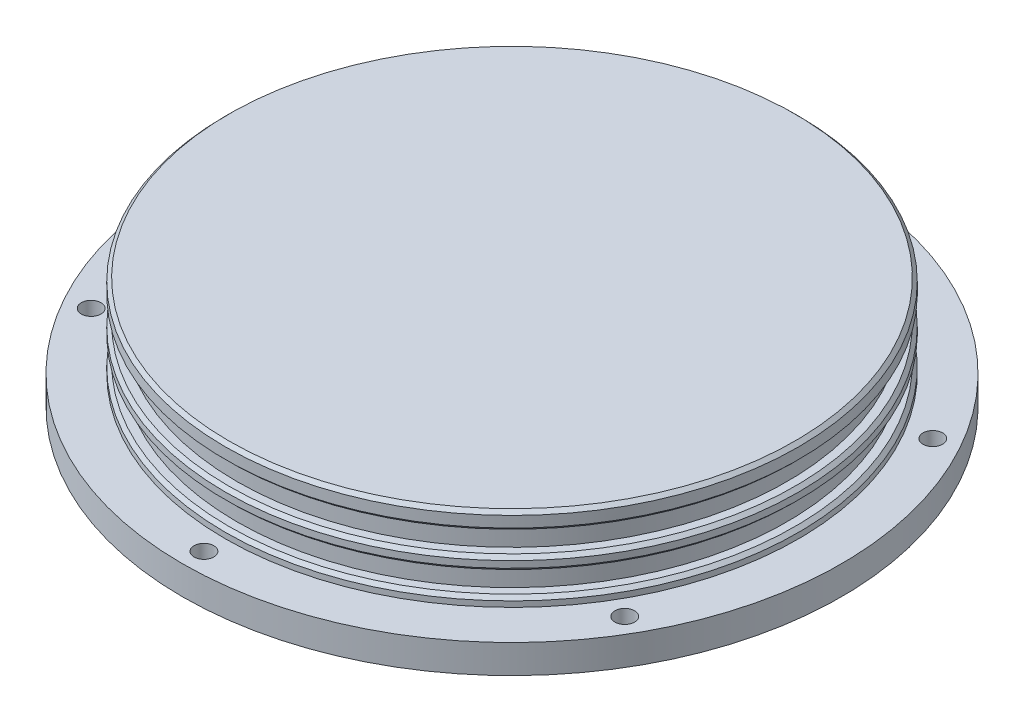
ISO-10303-21;
HEADER;
FILE_DESCRIPTION(('STEP AP214'),'2;1');
FILE_NAME('part.step','',(''),(''),'','','');
FILE_SCHEMA(('AUTOMOTIVE_DESIGN { 1 0 10303 214 1 1 1 1 }'));
ENDSEC;
DATA;
#1=APPLICATION_CONTEXT('core data for automotive mechanical design processes');
#2=APPLICATION_PROTOCOL_DEFINITION('international standard','automotive_design',2000,#1);
#3=PRODUCT_CONTEXT('',#1,'mechanical');
#4=PRODUCT('Part','Part','',(#3));
#5=PRODUCT_RELATED_PRODUCT_CATEGORY('part','',(#4));
#6=PRODUCT_DEFINITION_FORMATION('','',#4);
#7=PRODUCT_DEFINITION_CONTEXT('part definition',#1,'design');
#8=PRODUCT_DEFINITION('design','',#6,#7);
#9=PRODUCT_DEFINITION_SHAPE('','',#8);
#10=(LENGTH_UNIT() NAMED_UNIT(*) SI_UNIT(.MILLI.,.METRE.));
#11=(NAMED_UNIT(*) PLANE_ANGLE_UNIT() SI_UNIT($,.RADIAN.));
#12=(NAMED_UNIT(*) SI_UNIT($,.STERADIAN.) SOLID_ANGLE_UNIT());
#13=UNCERTAINTY_MEASURE_WITH_UNIT(LENGTH_MEASURE(1.E-05),#10,'distance_accuracy_value','');
#14=(GEOMETRIC_REPRESENTATION_CONTEXT(3) GLOBAL_UNCERTAINTY_ASSIGNED_CONTEXT((#13)) GLOBAL_UNIT_ASSIGNED_CONTEXT((#10,
#11,#12)) REPRESENTATION_CONTEXT('',''));
#15=CARTESIAN_POINT('',(0.,0.,0.));
#16=DIRECTION('',(0.,0.,1.));
#17=DIRECTION('',(1.,0.,0.));
#18=AXIS2_PLACEMENT_3D('',#15,#16,#17);
#19=CARTESIAN_POINT('',(0.,12.3825,0.));
#20=DIRECTION('',(0.,-1.,0.));
#21=DIRECTION('',(0.,0.,-1.));
#22=AXIS2_PLACEMENT_3D('',#19,#20,#21);
#23=CYLINDRICAL_SURFACE('',#22,31.75);
#24=CARTESIAN_POINT('',(0.,6.9226397264745,0.));
#25=DIRECTION('',(0.,-1.,0.));
#26=DIRECTION('',(0.,0.,-1.));
#27=AXIS2_PLACEMENT_3D('',#24,#25,#26);
#28=CIRCLE('',#27,31.75);
#29=CARTESIAN_POINT('',(0.,6.9226397264745,-31.75));
#30=VERTEX_POINT('',#29);
#31=EDGE_CURVE('E43',#30,#30,#28,.F.);
#32=ORIENTED_EDGE('',*,*,#31,.T.);
#33=EDGE_LOOP('',(#32));
#34=FACE_BOUND('',#33,.T.);
#35=CARTESIAN_POINT('',(0.,7.66193475746577,0.));
#36=DIRECTION('',(0.,1.,0.));
#37=DIRECTION('',(0.,0.,1.));
#38=AXIS2_PLACEMENT_3D('',#35,#36,#37);
#39=CIRCLE('',#38,31.75);
#40=CARTESIAN_POINT('',(0.,7.66193475746577,31.75));
#41=VERTEX_POINT('',#40);
#42=EDGE_CURVE('E122',#41,#41,#39,.F.);
#43=ORIENTED_EDGE('',*,*,#42,.T.);
#44=EDGE_LOOP('',(#43));
#45=FACE_BOUND('',#44,.T.);
#46=ADVANCED_FACE('F30',(#34,#45),#23,.T.);
#47=CARTESIAN_POINT('',(0.,8.04293475746576,31.75));
#48=DIRECTION('',(0.,1.,0.));
#49=DIRECTION('',(0.,0.,1.));
#50=AXIS2_PLACEMENT_3D('',#47,#48,#49);
#51=PLANE('',#50);
#52=CARTESIAN_POINT('',(0.,8.04293475746576,0.));
#53=DIRECTION('',(0.,1.,0.));
#54=DIRECTION('',(0.,0.,1.));
#55=AXIS2_PLACEMENT_3D('',#52,#53,#54);
#56=CIRCLE('',#55,31.369);
#57=CARTESIAN_POINT('',(0.,8.04293475746576,31.369));
#58=VERTEX_POINT('',#57);
#59=EDGE_CURVE('E38',#58,#58,#56,.T.);
#60=ORIENTED_EDGE('',*,*,#59,.T.);
#61=EDGE_LOOP('',(#60));
#62=FACE_BOUND('',#61,.T.);
#63=CARTESIAN_POINT('',(0.,8.04293475746576,0.));
#64=DIRECTION('',(0.,-1.,0.));
#65=DIRECTION('',(0.,0.,-1.));
#66=AXIS2_PLACEMENT_3D('',#63,#64,#65);
#67=CIRCLE('',#66,30.48);
#68=CARTESIAN_POINT('',(0.,8.04293475746576,-30.48));
#69=VERTEX_POINT('',#68);
#70=EDGE_CURVE('E92',#69,#69,#67,.T.);
#71=ORIENTED_EDGE('',*,*,#70,.T.);
#72=EDGE_LOOP('',(#71));
#73=FACE_BOUND('',#72,.T.);
#74=ADVANCED_FACE('F164',(#62,#73),#51,.T.);
#75=CARTESIAN_POINT('',(0.,0.,0.));
#76=DIRECTION('',(0.,-1.,0.));
#77=DIRECTION('',(0.,0.,-1.));
#78=AXIS2_PLACEMENT_3D('',#75,#76,#77);
#79=CYLINDRICAL_SURFACE('',#78,30.48);
#80=CARTESIAN_POINT('',(0.,10.4051347574658,0.));
#81=DIRECTION('',(0.,-1.,0.));
#82=DIRECTION('',(0.,0.,-1.));
#83=AXIS2_PLACEMENT_3D('',#80,#81,#82);
#84=CIRCLE('',#83,30.48);
#85=CARTESIAN_POINT('',(0.,10.4051347574658,-30.48));
#86=VERTEX_POINT('',#85);
#87=EDGE_CURVE('E89',#86,#86,#84,.T.);
#88=ORIENTED_EDGE('',*,*,#87,.T.);
#89=EDGE_LOOP('',(#88));
#90=FACE_BOUND('',#89,.T.);
#91=ORIENTED_EDGE('',*,*,#70,.F.);
#92=EDGE_LOOP('',(#91));
#93=FACE_BOUND('',#92,.T.);
#94=ADVANCED_FACE('F168',(#90,#93),#79,.T.);
#95=CARTESIAN_POINT('',(0.,10.4051347574658,31.75));
#96=DIRECTION('',(0.,-1.,0.));
#97=DIRECTION('',(0.,0.,-1.));
#98=AXIS2_PLACEMENT_3D('',#95,#96,#97);
#99=PLANE('',#98);
#100=CARTESIAN_POINT('',(0.,10.4051347574658,0.));
#101=DIRECTION('',(0.,-1.,0.));
#102=DIRECTION('',(0.,0.,-1.));
#103=AXIS2_PLACEMENT_3D('',#100,#101,#102);
#104=CIRCLE('',#103,31.369);
#105=CARTESIAN_POINT('',(0.,10.4051347574658,-31.369));
#106=VERTEX_POINT('',#105);
#107=EDGE_CURVE('E10',#106,#106,#104,.T.);
#108=ORIENTED_EDGE('',*,*,#107,.T.);
#109=EDGE_LOOP('',(#108));
#110=FACE_BOUND('',#109,.T.);
#111=ORIENTED_EDGE('',*,*,#87,.F.);
#112=EDGE_LOOP('',(#111));
#113=FACE_BOUND('',#112,.T.);
#114=ADVANCED_FACE('F351',(#110,#113),#99,.T.);
#115=CARTESIAN_POINT('',(0.,12.3825,0.));
#116=DIRECTION('',(0.,1.,0.));
#117=DIRECTION('',(0.,0.,1.));
#118=AXIS2_PLACEMENT_3D('',#115,#116,#117);
#119=PLANE('',#118);
#120=CARTESIAN_POINT('',(0.,12.3825,0.));
#121=DIRECTION('',(0.,1.,0.));
#122=DIRECTION('',(0.,0.,1.));
#123=AXIS2_PLACEMENT_3D('',#120,#121,#122);
#124=CIRCLE('',#123,31.369);
#125=CARTESIAN_POINT('',(0.,12.3825,31.369));
#126=VERTEX_POINT('',#125);
#127=EDGE_CURVE('E104',#126,#126,#124,.T.);
#128=ORIENTED_EDGE('',*,*,#127,.T.);
#129=EDGE_LOOP('',(#128));
#130=FACE_BOUND('',#129,.T.);
#131=ADVANCED_FACE('F158',(#130),#119,.T.);
#132=CARTESIAN_POINT('',(0.,12.0015,0.));
#133=DIRECTION('',(0.,1.,0.));
#134=DIRECTION('',(0.,0.,1.));
#135=AXIS2_PLACEMENT_3D('',#132,#133,#134);
#136=CIRCLE('',#135,31.75);
#137=CARTESIAN_POINT('',(0.,12.0015,31.75));
#138=VERTEX_POINT('',#137);
#139=EDGE_CURVE('E110',#138,#138,#136,.F.);
#140=ORIENTED_EDGE('',*,*,#139,.T.);
#141=EDGE_LOOP('',(#140));
#142=FACE_BOUND('',#141,.T.);
#143=CARTESIAN_POINT('',(0.,10.7861347574658,0.));
#144=DIRECTION('',(0.,-1.,0.));
#145=DIRECTION('',(0.,0.,-1.));
#146=AXIS2_PLACEMENT_3D('',#143,#144,#145);
#147=CIRCLE('',#146,31.75);
#148=CARTESIAN_POINT('',(0.,10.7861347574658,-31.75));
#149=VERTEX_POINT('',#148);
#150=EDGE_CURVE('E107',#149,#149,#147,.F.);
#151=ORIENTED_EDGE('',*,*,#150,.T.);
#152=EDGE_LOOP('',(#151));
#153=FACE_BOUND('',#152,.T.);
#154=ADVANCED_FACE('F152',(#142,#153),#23,.T.);
#155=CARTESIAN_POINT('',(0.,4.1794397264745,31.75));
#156=DIRECTION('',(0.,1.,0.));
#157=DIRECTION('',(0.,0.,1.));
#158=AXIS2_PLACEMENT_3D('',#155,#156,#157);
#159=PLANE('',#158);
#160=CARTESIAN_POINT('',(0.,4.1794397264745,0.));
#161=DIRECTION('',(0.,1.,0.));
#162=DIRECTION('',(0.,0.,1.));
#163=AXIS2_PLACEMENT_3D('',#160,#161,#162);
#164=CIRCLE('',#163,31.369);
#165=CARTESIAN_POINT('',(0.,4.1794397264745,31.369));
#166=VERTEX_POINT('',#165);
#167=EDGE_CURVE('E116',#166,#166,#164,.T.);
#168=ORIENTED_EDGE('',*,*,#167,.T.);
#169=EDGE_LOOP('',(#168));
#170=FACE_BOUND('',#169,.T.);
#171=CARTESIAN_POINT('',(0.,4.1794397264745,0.));
#172=DIRECTION('',(0.,-1.,0.));
#173=DIRECTION('',(0.,0.,-1.));
#174=AXIS2_PLACEMENT_3D('',#171,#172,#173);
#175=CIRCLE('',#174,30.48);
#176=CARTESIAN_POINT('',(0.,4.1794397264745,-30.48));
#177=VERTEX_POINT('',#176);
#178=EDGE_CURVE('E86',#177,#177,#175,.T.);
#179=ORIENTED_EDGE('',*,*,#178,.T.);
#180=EDGE_LOOP('',(#179));
#181=FACE_BOUND('',#180,.T.);
#182=ADVANCED_FACE('F147',(#170,#181),#159,.T.);
#183=CARTESIAN_POINT('',(0.,0.,0.));
#184=DIRECTION('',(0.,-1.,0.));
#185=DIRECTION('',(0.,0.,-1.));
#186=AXIS2_PLACEMENT_3D('',#183,#184,#185);
#187=CYLINDRICAL_SURFACE('',#186,30.48);
#188=CARTESIAN_POINT('',(0.,6.5416397264745,0.));
#189=DIRECTION('',(0.,-1.,0.));
#190=DIRECTION('',(0.,0.,-1.));
#191=AXIS2_PLACEMENT_3D('',#188,#189,#190);
#192=CIRCLE('',#191,30.48);
#193=CARTESIAN_POINT('',(0.,6.5416397264745,-30.48));
#194=VERTEX_POINT('',#193);
#195=EDGE_CURVE('E50',#194,#194,#192,.T.);
#196=ORIENTED_EDGE('',*,*,#195,.T.);
#197=EDGE_LOOP('',(#196));
#198=FACE_BOUND('',#197,.T.);
#199=ORIENTED_EDGE('',*,*,#178,.F.);
#200=EDGE_LOOP('',(#199));
#201=FACE_BOUND('',#200,.T.);
#202=ADVANCED_FACE('F141',(#198,#201),#187,.T.);
#203=CARTESIAN_POINT('',(0.,6.5416397264745,31.75));
#204=DIRECTION('',(0.,-1.,0.));
#205=DIRECTION('',(0.,0.,-1.));
#206=AXIS2_PLACEMENT_3D('',#203,#204,#205);
#207=PLANE('',#206);
#208=CARTESIAN_POINT('',(0.,6.5416397264745,0.));
#209=DIRECTION('',(0.,-1.,0.));
#210=DIRECTION('',(0.,0.,-1.));
#211=AXIS2_PLACEMENT_3D('',#208,#209,#210);
#212=CIRCLE('',#211,31.369);
#213=CARTESIAN_POINT('',(0.,6.5416397264745,-31.369));
#214=VERTEX_POINT('',#213);
#215=EDGE_CURVE('E119',#214,#214,#212,.T.);
#216=ORIENTED_EDGE('',*,*,#215,.T.);
#217=EDGE_LOOP('',(#216));
#218=FACE_BOUND('',#217,.T.);
#219=ORIENTED_EDGE('',*,*,#195,.F.);
#220=EDGE_LOOP('',(#219));
#221=FACE_BOUND('',#220,.T.);
#222=ADVANCED_FACE('F137',(#218,#221),#207,.T.);
#223=CARTESIAN_POINT('',(0.,0.,0.));
#224=DIRECTION('',(0.,1.,0.));
#225=DIRECTION('',(0.,0.,1.));
#226=AXIS2_PLACEMENT_3D('',#223,#224,#225);
#227=PLANE('',#226);
#228=CARTESIAN_POINT('',(-29.5585295629176,0.,17.065625));
#229=DIRECTION('',(0.,-1.,0.));
#230=DIRECTION('',(0.,0.,-1.));
#231=AXIS2_PLACEMENT_3D('',#228,#229,#230);
#232=CIRCLE('',#231,1.0922);
#233=CARTESIAN_POINT('',(-29.5585295629176,0.,15.973425));
#234=VERTEX_POINT('',#233);
#235=EDGE_CURVE('E75',#234,#234,#232,.T.);
#236=ORIENTED_EDGE('',*,*,#235,.F.);
#237=EDGE_LOOP('',(#236));
#238=FACE_BOUND('',#237,.T.);
#239=CARTESIAN_POINT('',(0.,0.,34.13125));
#240=DIRECTION('',(0.,-1.,0.));
#241=DIRECTION('',(0.,0.,-1.));
#242=AXIS2_PLACEMENT_3D('',#239,#240,#241);
#243=CIRCLE('',#242,1.0922);
#244=CARTESIAN_POINT('',(0.,0.,33.03905));
#245=VERTEX_POINT('',#244);
#246=EDGE_CURVE('E65',#245,#245,#243,.T.);
#247=ORIENTED_EDGE('',*,*,#246,.F.);
#248=EDGE_LOOP('',(#247));
#249=FACE_BOUND('',#248,.T.);
#250=CARTESIAN_POINT('',(29.5585295629176,0.,17.065625));
#251=DIRECTION('',(0.,-1.,0.));
#252=DIRECTION('',(0.,0.,-1.));
#253=AXIS2_PLACEMENT_3D('',#250,#251,#252);
#254=CIRCLE('',#253,1.0922);
#255=CARTESIAN_POINT('',(29.5585295629176,0.,15.973425));
#256=VERTEX_POINT('',#255);
#257=EDGE_CURVE('E62',#256,#256,#254,.T.);
#258=ORIENTED_EDGE('',*,*,#257,.F.);
#259=EDGE_LOOP('',(#258));
#260=FACE_BOUND('',#259,.T.);
#261=CARTESIAN_POINT('',(29.5585295629176,0.,-17.065625));
#262=DIRECTION('',(0.,-1.,0.));
#263=DIRECTION('',(0.,0.,-1.));
#264=AXIS2_PLACEMENT_3D('',#261,#262,#263);
#265=CIRCLE('',#264,1.0922);
#266=CARTESIAN_POINT('',(29.5585295629176,0.,-18.157825));
#267=VERTEX_POINT('',#266);
#268=EDGE_CURVE('E59',#267,#267,#265,.T.);
#269=ORIENTED_EDGE('',*,*,#268,.F.);
#270=EDGE_LOOP('',(#269));
#271=FACE_BOUND('',#270,.T.);
#272=CARTESIAN_POINT('',(0.,0.,-34.13125));
#273=DIRECTION('',(0.,-1.,0.));
#274=DIRECTION('',(0.,0.,-1.));
#275=AXIS2_PLACEMENT_3D('',#272,#273,#274);
#276=CIRCLE('',#275,1.0922);
#277=CARTESIAN_POINT('',(0.,0.,-35.22345));
#278=VERTEX_POINT('',#277);
#279=EDGE_CURVE('E55',#278,#278,#276,.T.);
#280=ORIENTED_EDGE('',*,*,#279,.F.);
#281=EDGE_LOOP('',(#280));
#282=FACE_BOUND('',#281,.T.);
#283=CARTESIAN_POINT('',(-29.5585295629176,0.,-17.065625));
#284=DIRECTION('',(0.,-1.,0.));
#285=DIRECTION('',(0.,0.,-1.));
#286=AXIS2_PLACEMENT_3D('',#283,#284,#285);
#287=CIRCLE('',#286,1.0922);
#288=CARTESIAN_POINT('',(-29.5585295629176,0.,-18.157825));
#289=VERTEX_POINT('',#288);
#290=EDGE_CURVE('E51',#289,#289,#287,.T.);
#291=ORIENTED_EDGE('',*,*,#290,.F.);
#292=EDGE_LOOP('',(#291));
#293=FACE_BOUND('',#292,.T.);
#294=CARTESIAN_POINT('',(0.,0.,0.));
#295=DIRECTION('',(0.,1.,0.));
#296=DIRECTION('',(0.,0.,1.));
#297=AXIS2_PLACEMENT_3D('',#294,#295,#296);
#298=CIRCLE('',#297,36.5125);
#299=CARTESIAN_POINT('',(0.,0.,36.5125));
#300=VERTEX_POINT('',#299);
#301=EDGE_CURVE('E98',#300,#300,#298,.T.);
#302=ORIENTED_EDGE('',*,*,#301,.F.);
#303=EDGE_LOOP('',(#302));
#304=FACE_BOUND('',#303,.T.);
#305=ADVANCED_FACE('F140',(#238,#249,#260,#271,#282,#293,#304),#227,.F.);
#306=CARTESIAN_POINT('',(0.,3.175,0.));
#307=DIRECTION('',(0.,-1.,0.));
#308=DIRECTION('',(0.,0.,-1.));
#309=AXIS2_PLACEMENT_3D('',#306,#307,#308);
#310=CYLINDRICAL_SURFACE('',#309,36.5125);
#311=CARTESIAN_POINT('',(0.,3.175,0.));
#312=DIRECTION('',(0.,1.,0.));
#313=DIRECTION('',(0.,0.,1.));
#314=AXIS2_PLACEMENT_3D('',#311,#312,#313);
#315=CIRCLE('',#314,36.5125);
#316=CARTESIAN_POINT('',(0.,3.175,36.5125));
#317=VERTEX_POINT('',#316);
#318=EDGE_CURVE('E101',#317,#317,#315,.T.);
#319=ORIENTED_EDGE('',*,*,#318,.F.);
#320=EDGE_LOOP('',(#319));
#321=FACE_BOUND('',#320,.T.);
#322=ORIENTED_EDGE('',*,*,#301,.T.);
#323=EDGE_LOOP('',(#322));
#324=FACE_BOUND('',#323,.T.);
#325=ADVANCED_FACE('F32',(#321,#324),#310,.T.);
#326=CARTESIAN_POINT('',(0.,3.175,0.));
#327=DIRECTION('',(0.,1.,0.));
#328=DIRECTION('',(0.,0.,1.));
#329=AXIS2_PLACEMENT_3D('',#326,#327,#328);
#330=PLANE('',#329);
#331=CARTESIAN_POINT('',(-29.5585295629176,3.175,17.065625));
#332=DIRECTION('',(0.,1.,0.));
#333=DIRECTION('',(0.,0.,1.));
#334=AXIS2_PLACEMENT_3D('',#331,#332,#333);
#335=CIRCLE('',#334,1.0922);
#336=CARTESIAN_POINT('',(-29.5585295629176,3.175,18.157825));
#337=VERTEX_POINT('',#336);
#338=EDGE_CURVE('E34',#337,#337,#335,.T.);
#339=ORIENTED_EDGE('',*,*,#338,.F.);
#340=EDGE_LOOP('',(#339));
#341=FACE_BOUND('',#340,.T.);
#342=CARTESIAN_POINT('',(0.,3.175,34.13125));
#343=DIRECTION('',(0.,1.,0.));
#344=DIRECTION('',(0.,0.,1.));
#345=AXIS2_PLACEMENT_3D('',#342,#343,#344);
#346=CIRCLE('',#345,1.0922);
#347=CARTESIAN_POINT('',(0.,3.175,35.22345));
#348=VERTEX_POINT('',#347);
#349=EDGE_CURVE('E63',#348,#348,#346,.T.);
#350=ORIENTED_EDGE('',*,*,#349,.F.);
#351=EDGE_LOOP('',(#350));
#352=FACE_BOUND('',#351,.T.);
#353=CARTESIAN_POINT('',(29.5585295629176,3.175,17.065625));
#354=DIRECTION('',(0.,1.,0.));
#355=DIRECTION('',(0.,0.,1.));
#356=AXIS2_PLACEMENT_3D('',#353,#354,#355);
#357=CIRCLE('',#356,1.0922);
#358=CARTESIAN_POINT('',(29.5585295629176,3.175,18.157825));
#359=VERTEX_POINT('',#358);
#360=EDGE_CURVE('E60',#359,#359,#357,.T.);
#361=ORIENTED_EDGE('',*,*,#360,.F.);
#362=EDGE_LOOP('',(#361));
#363=FACE_BOUND('',#362,.T.);
#364=CARTESIAN_POINT('',(29.5585295629176,3.175,-17.065625));
#365=DIRECTION('',(0.,1.,0.));
#366=DIRECTION('',(0.,0.,1.));
#367=AXIS2_PLACEMENT_3D('',#364,#365,#366);
#368=CIRCLE('',#367,1.0922);
#369=CARTESIAN_POINT('',(29.5585295629176,3.175,-15.973425));
#370=VERTEX_POINT('',#369);
#371=EDGE_CURVE('E56',#370,#370,#368,.T.);
#372=ORIENTED_EDGE('',*,*,#371,.F.);
#373=EDGE_LOOP('',(#372));
#374=FACE_BOUND('',#373,.T.);
#375=CARTESIAN_POINT('',(0.,3.175,-34.13125));
#376=DIRECTION('',(0.,1.,0.));
#377=DIRECTION('',(0.,0.,1.));
#378=AXIS2_PLACEMENT_3D('',#375,#376,#377);
#379=CIRCLE('',#378,1.0922);
#380=CARTESIAN_POINT('',(0.,3.175,-33.03905));
#381=VERTEX_POINT('',#380);
#382=EDGE_CURVE('E52',#381,#381,#379,.T.);
#383=ORIENTED_EDGE('',*,*,#382,.F.);
#384=EDGE_LOOP('',(#383));
#385=FACE_BOUND('',#384,.T.);
#386=CARTESIAN_POINT('',(-29.5585295629176,3.175,-17.065625));
#387=DIRECTION('',(0.,1.,0.));
#388=DIRECTION('',(0.,0.,1.));
#389=AXIS2_PLACEMENT_3D('',#386,#387,#388);
#390=CIRCLE('',#389,1.0922);
#391=CARTESIAN_POINT('',(-29.5585295629176,3.175,-15.973425));
#392=VERTEX_POINT('',#391);
#393=EDGE_CURVE('E47',#392,#392,#390,.T.);
#394=ORIENTED_EDGE('',*,*,#393,.F.);
#395=EDGE_LOOP('',(#394));
#396=FACE_BOUND('',#395,.T.);
#397=ORIENTED_EDGE('',*,*,#318,.T.);
#398=EDGE_LOOP('',(#397));
#399=FACE_BOUND('',#398,.T.);
#400=CARTESIAN_POINT('',(0.,3.175,0.));
#401=DIRECTION('',(0.,1.,0.));
#402=DIRECTION('',(0.,0.,1.));
#403=AXIS2_PLACEMENT_3D('',#400,#401,#402);
#404=CIRCLE('',#403,31.75);
#405=CARTESIAN_POINT('',(0.,3.175,31.75));
#406=VERTEX_POINT('',#405);
#407=EDGE_CURVE('E95',#406,#406,#404,.T.);
#408=ORIENTED_EDGE('',*,*,#407,.F.);
#409=EDGE_LOOP('',(#408));
#410=FACE_BOUND('',#409,.T.);
#411=ADVANCED_FACE('F175',(#341,#352,#363,#374,#385,#396,#399,#410),#330,.T.);
#412=CARTESIAN_POINT('',(0.,3.79843972647449,0.));
#413=DIRECTION('',(0.,1.,0.));
#414=DIRECTION('',(0.,0.,1.));
#415=AXIS2_PLACEMENT_3D('',#412,#413,#414);
#416=CIRCLE('',#415,31.75);
#417=CARTESIAN_POINT('',(0.,3.79843972647449,31.75));
#418=VERTEX_POINT('',#417);
#419=EDGE_CURVE('E113',#418,#418,#416,.F.);
#420=ORIENTED_EDGE('',*,*,#419,.T.);
#421=EDGE_LOOP('',(#420));
#422=FACE_BOUND('',#421,.T.);
#423=ORIENTED_EDGE('',*,*,#407,.T.);
#424=EDGE_LOOP('',(#423));
#425=FACE_BOUND('',#424,.T.);
#426=ADVANCED_FACE('F161',(#422,#425),#23,.T.);
#427=CARTESIAN_POINT('',(0.,12.3825,0.));
#428=DIRECTION('',(0.,-1.,0.));
#429=DIRECTION('',(0.,0.,-1.));
#430=AXIS2_PLACEMENT_3D('',#427,#428,#429);
#431=CONICAL_SURFACE('',#430,31.369,0.785398163397457);
#432=ORIENTED_EDGE('',*,*,#139,.F.);
#433=EDGE_LOOP('',(#432));
#434=FACE_BOUND('',#433,.T.);
#435=ORIENTED_EDGE('',*,*,#127,.F.);
#436=EDGE_LOOP('',(#435));
#437=FACE_BOUND('',#436,.T.);
#438=ADVANCED_FACE('F174',(#434,#437),#431,.T.);
#439=CARTESIAN_POINT('',(0.,3.79843972647449,0.));
#440=DIRECTION('',(0.,-1.,0.));
#441=DIRECTION('',(0.,0.,-1.));
#442=AXIS2_PLACEMENT_3D('',#439,#440,#441);
#443=CONICAL_SURFACE('',#442,31.75,0.785398163397457);
#444=ORIENTED_EDGE('',*,*,#167,.F.);
#445=EDGE_LOOP('',(#444));
#446=FACE_BOUND('',#445,.T.);
#447=ORIENTED_EDGE('',*,*,#419,.F.);
#448=EDGE_LOOP('',(#447));
#449=FACE_BOUND('',#448,.T.);
#450=ADVANCED_FACE('F133',(#446,#449),#443,.T.);
#451=CARTESIAN_POINT('',(0.,6.5416397264745,0.));
#452=DIRECTION('',(0.,1.,0.));
#453=DIRECTION('',(0.,0.,1.));
#454=AXIS2_PLACEMENT_3D('',#451,#452,#453);
#455=CONICAL_SURFACE('',#454,31.369,0.785398163397439);
#456=ORIENTED_EDGE('',*,*,#31,.F.);
#457=EDGE_LOOP('',(#456));
#458=FACE_BOUND('',#457,.T.);
#459=ORIENTED_EDGE('',*,*,#215,.F.);
#460=EDGE_LOOP('',(#459));
#461=FACE_BOUND('',#460,.T.);
#462=ADVANCED_FACE('F129',(#458,#461),#455,.T.);
#463=CARTESIAN_POINT('',(0.,7.66193475746577,0.));
#464=DIRECTION('',(0.,-1.,0.));
#465=DIRECTION('',(0.,0.,-1.));
#466=AXIS2_PLACEMENT_3D('',#463,#464,#465);
#467=CONICAL_SURFACE('',#466,31.75,0.785398163397448);
#468=ORIENTED_EDGE('',*,*,#59,.F.);
#469=EDGE_LOOP('',(#468));
#470=FACE_BOUND('',#469,.T.);
#471=ORIENTED_EDGE('',*,*,#42,.F.);
#472=EDGE_LOOP('',(#471));
#473=FACE_BOUND('',#472,.T.);
#474=ADVANCED_FACE('F132',(#470,#473),#467,.T.);
#475=CARTESIAN_POINT('',(0.,10.4051347574658,0.));
#476=DIRECTION('',(0.,1.,0.));
#477=DIRECTION('',(0.,0.,1.));
#478=AXIS2_PLACEMENT_3D('',#475,#476,#477);
#479=CONICAL_SURFACE('',#478,31.369,0.785398163397439);
#480=ORIENTED_EDGE('',*,*,#150,.F.);
#481=EDGE_LOOP('',(#480));
#482=FACE_BOUND('',#481,.T.);
#483=ORIENTED_EDGE('',*,*,#107,.F.);
#484=EDGE_LOOP('',(#483));
#485=FACE_BOUND('',#484,.T.);
#486=ADVANCED_FACE('F198',(#482,#485),#479,.T.);
#487=CARTESIAN_POINT('',(-29.5585295629176,0.,-17.065625));
#488=DIRECTION('',(0.,-1.,0.));
#489=DIRECTION('',(0.,0.,-1.));
#490=AXIS2_PLACEMENT_3D('',#487,#488,#489);
#491=CYLINDRICAL_SURFACE('',#490,1.0922);
#492=ORIENTED_EDGE('',*,*,#393,.T.);
#493=EDGE_LOOP('',(#492));
#494=FACE_BOUND('',#493,.T.);
#495=ORIENTED_EDGE('',*,*,#290,.T.);
#496=EDGE_LOOP('',(#495));
#497=FACE_BOUND('',#496,.T.);
#498=ADVANCED_FACE('F202',(#494,#497),#491,.F.);
#499=CARTESIAN_POINT('',(0.,0.,-34.13125));
#500=DIRECTION('',(0.,-1.,0.));
#501=DIRECTION('',(0.,0.,-1.));
#502=AXIS2_PLACEMENT_3D('',#499,#500,#501);
#503=CYLINDRICAL_SURFACE('',#502,1.0922);
#504=ORIENTED_EDGE('',*,*,#382,.T.);
#505=EDGE_LOOP('',(#504));
#506=FACE_BOUND('',#505,.T.);
#507=ORIENTED_EDGE('',*,*,#279,.T.);
#508=EDGE_LOOP('',(#507));
#509=FACE_BOUND('',#508,.T.);
#510=ADVANCED_FACE('F206',(#506,#509),#503,.F.);
#511=CARTESIAN_POINT('',(29.5585295629176,0.,-17.065625));
#512=DIRECTION('',(0.,-1.,0.));
#513=DIRECTION('',(0.,0.,-1.));
#514=AXIS2_PLACEMENT_3D('',#511,#512,#513);
#515=CYLINDRICAL_SURFACE('',#514,1.0922);
#516=ORIENTED_EDGE('',*,*,#371,.T.);
#517=EDGE_LOOP('',(#516));
#518=FACE_BOUND('',#517,.T.);
#519=ORIENTED_EDGE('',*,*,#268,.T.);
#520=EDGE_LOOP('',(#519));
#521=FACE_BOUND('',#520,.T.);
#522=ADVANCED_FACE('F210',(#518,#521),#515,.F.);
#523=CARTESIAN_POINT('',(29.5585295629176,0.,17.065625));
#524=DIRECTION('',(0.,-1.,0.));
#525=DIRECTION('',(0.,0.,-1.));
#526=AXIS2_PLACEMENT_3D('',#523,#524,#525);
#527=CYLINDRICAL_SURFACE('',#526,1.0922);
#528=ORIENTED_EDGE('',*,*,#360,.T.);
#529=EDGE_LOOP('',(#528));
#530=FACE_BOUND('',#529,.T.);
#531=ORIENTED_EDGE('',*,*,#257,.T.);
#532=EDGE_LOOP('',(#531));
#533=FACE_BOUND('',#532,.T.);
#534=ADVANCED_FACE('F214',(#530,#533),#527,.F.);
#535=CARTESIAN_POINT('',(0.,0.,34.13125));
#536=DIRECTION('',(0.,-1.,0.));
#537=DIRECTION('',(0.,0.,-1.));
#538=AXIS2_PLACEMENT_3D('',#535,#536,#537);
#539=CYLINDRICAL_SURFACE('',#538,1.0922);
#540=ORIENTED_EDGE('',*,*,#349,.T.);
#541=EDGE_LOOP('',(#540));
#542=FACE_BOUND('',#541,.T.);
#543=ORIENTED_EDGE('',*,*,#246,.T.);
#544=EDGE_LOOP('',(#543));
#545=FACE_BOUND('',#544,.T.);
#546=ADVANCED_FACE('F218',(#542,#545),#539,.F.);
#547=CARTESIAN_POINT('',(-29.5585295629176,0.,17.065625));
#548=DIRECTION('',(0.,-1.,0.));
#549=DIRECTION('',(0.,0.,-1.));
#550=AXIS2_PLACEMENT_3D('',#547,#548,#549);
#551=CYLINDRICAL_SURFACE('',#550,1.0922);
#552=ORIENTED_EDGE('',*,*,#338,.T.);
#553=EDGE_LOOP('',(#552));
#554=FACE_BOUND('',#553,.T.);
#555=ORIENTED_EDGE('',*,*,#235,.T.);
#556=EDGE_LOOP('',(#555));
#557=FACE_BOUND('',#556,.T.);
#558=ADVANCED_FACE('F222',(#554,#557),#551,.F.);
#559=CLOSED_SHELL('',(#46,#74,#94,#114,#131,#154,#182,#202,#222,#305,#325,#411,#426,#438,#450,
#462,#474,#486,#498,#510,#522,#534,#546,#558));
#560=MANIFOLD_SOLID_BREP('B2',#559);
#561=ADVANCED_BREP_SHAPE_REPRESENTATION('',(#18,#560),#14);
#562=SHAPE_DEFINITION_REPRESENTATION(#9,#561);
ENDSEC;
END-ISO-10303-21;
